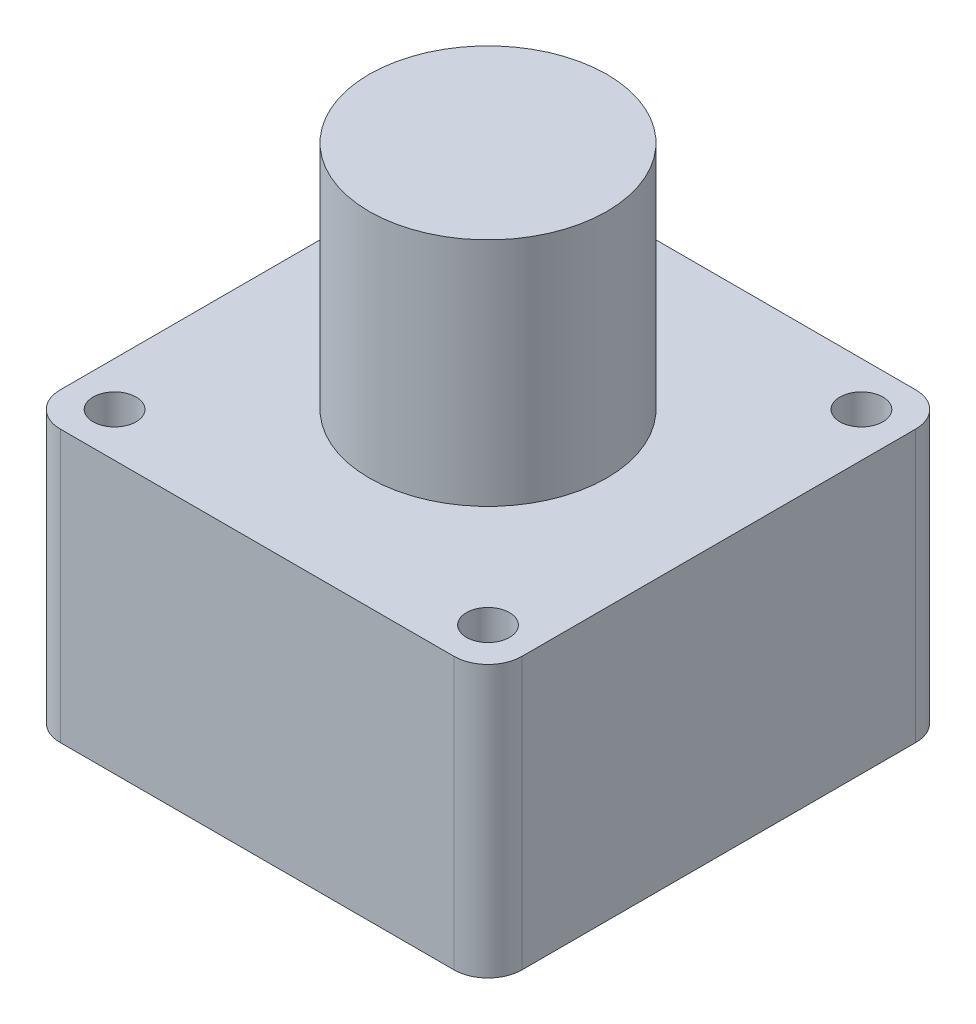
ISO-10303-21;
HEADER;
FILE_DESCRIPTION(('STEP AP214'),'2;1');
FILE_NAME('part.step','',(''),(''),'','','');
FILE_SCHEMA(('AUTOMOTIVE_DESIGN { 1 0 10303 214 1 1 1 1 }'));
ENDSEC;
DATA;
#1=APPLICATION_CONTEXT('core data for automotive mechanical design processes');
#2=APPLICATION_PROTOCOL_DEFINITION('international standard','automotive_design',2000,#1);
#3=PRODUCT_CONTEXT('',#1,'mechanical');
#4=PRODUCT('Part','Part','',(#3));
#5=PRODUCT_RELATED_PRODUCT_CATEGORY('part','',(#4));
#6=PRODUCT_DEFINITION_FORMATION('','',#4);
#7=PRODUCT_DEFINITION_CONTEXT('part definition',#1,'design');
#8=PRODUCT_DEFINITION('design','',#6,#7);
#9=PRODUCT_DEFINITION_SHAPE('','',#8);
#10=(LENGTH_UNIT() NAMED_UNIT(*) SI_UNIT(.MILLI.,.METRE.));
#11=(NAMED_UNIT(*) PLANE_ANGLE_UNIT() SI_UNIT($,.RADIAN.));
#12=(NAMED_UNIT(*) SI_UNIT($,.STERADIAN.) SOLID_ANGLE_UNIT());
#13=UNCERTAINTY_MEASURE_WITH_UNIT(LENGTH_MEASURE(1.E-05),#10,'distance_accuracy_value','');
#14=(GEOMETRIC_REPRESENTATION_CONTEXT(3) GLOBAL_UNCERTAINTY_ASSIGNED_CONTEXT((#13)) GLOBAL_UNIT_ASSIGNED_CONTEXT((#10,
#11,#12)) REPRESENTATION_CONTEXT('',''));
#15=CARTESIAN_POINT('',(0.,0.,0.));
#16=DIRECTION('',(0.,0.,1.));
#17=DIRECTION('',(1.,0.,0.));
#18=AXIS2_PLACEMENT_3D('',#15,#16,#17);
#19=CARTESIAN_POINT('',(-29.,40.,-29.));
#20=DIRECTION('',(0.,-1.,0.));
#21=DIRECTION('',(0.,0.,-1.));
#22=AXIS2_PLACEMENT_3D('',#19,#20,#21);
#23=CYLINDRICAL_SURFACE('',#22,5.);
#24=CARTESIAN_POINT('',(-29.,0.,-29.));
#25=DIRECTION('',(0.,1.,0.));
#26=DIRECTION('',(0.,0.,1.));
#27=AXIS2_PLACEMENT_3D('',#24,#25,#26);
#28=CIRCLE('',#27,5.);
#29=CARTESIAN_POINT('',(-29.,0.,-34.));
#30=VERTEX_POINT('',#29);
#31=CARTESIAN_POINT('',(-34.,0.,-29.));
#32=VERTEX_POINT('',#31);
#33=EDGE_CURVE('E141',#30,#32,#28,.T.);
#34=ORIENTED_EDGE('',*,*,#33,.T.);
#35=DIRECTION('',(0.,-1.,0.));
#36=VECTOR('',#35,1.);
#37=CARTESIAN_POINT('',(-34.,40.,-29.));
#38=LINE('',#37,#36);
#39=CARTESIAN_POINT('',(-34.,40.,-29.));
#40=VERTEX_POINT('',#39);
#41=EDGE_CURVE('E41',#40,#32,#38,.T.);
#42=ORIENTED_EDGE('',*,*,#41,.F.);
#43=CARTESIAN_POINT('',(-29.,40.,-29.));
#44=DIRECTION('',(0.,1.,0.));
#45=DIRECTION('',(0.,0.,1.));
#46=AXIS2_PLACEMENT_3D('',#43,#44,#45);
#47=CIRCLE('',#46,5.);
#48=CARTESIAN_POINT('',(-29.,40.,-34.));
#49=VERTEX_POINT('',#48);
#50=EDGE_CURVE('E167',#49,#40,#47,.T.);
#51=ORIENTED_EDGE('',*,*,#50,.F.);
#52=DIRECTION('',(0.,-1.,0.));
#53=VECTOR('',#52,1.);
#54=CARTESIAN_POINT('',(-29.,40.,-34.));
#55=LINE('',#54,#53);
#56=EDGE_CURVE('E56',#49,#30,#55,.T.);
#57=ORIENTED_EDGE('',*,*,#56,.T.);
#58=EDGE_LOOP('',(#34,#42,#51,#57));
#59=FACE_BOUND('',#58,.T.);
#60=ADVANCED_FACE('F38',(#59),#23,.T.);
#61=CARTESIAN_POINT('',(-34.,40.,-29.));
#62=DIRECTION('',(1.,0.,0.));
#63=DIRECTION('',(0.,0.,-1.));
#64=AXIS2_PLACEMENT_3D('',#61,#62,#63);
#65=PLANE('',#64);
#66=DIRECTION('',(0.,0.,1.));
#67=VECTOR('',#66,1.);
#68=CARTESIAN_POINT('',(-34.,0.,-29.));
#69=LINE('',#68,#67);
#70=CARTESIAN_POINT('',(-34.,0.,29.));
#71=VERTEX_POINT('',#70);
#72=EDGE_CURVE('E144',#32,#71,#69,.T.);
#73=ORIENTED_EDGE('',*,*,#72,.T.);
#74=DIRECTION('',(0.,-1.,0.));
#75=VECTOR('',#74,1.);
#76=CARTESIAN_POINT('',(-34.,40.,29.));
#77=LINE('',#76,#75);
#78=CARTESIAN_POINT('',(-34.,40.,29.));
#79=VERTEX_POINT('',#78);
#80=EDGE_CURVE('E181',#79,#71,#77,.T.);
#81=ORIENTED_EDGE('',*,*,#80,.F.);
#82=DIRECTION('',(0.,0.,1.));
#83=VECTOR('',#82,1.);
#84=CARTESIAN_POINT('',(-34.,40.,-29.));
#85=LINE('',#84,#83);
#86=EDGE_CURVE('E95',#40,#79,#85,.T.);
#87=ORIENTED_EDGE('',*,*,#86,.F.);
#88=ORIENTED_EDGE('',*,*,#41,.T.);
#89=EDGE_LOOP('',(#73,#81,#87,#88));
#90=FACE_BOUND('',#89,.T.);
#91=ADVANCED_FACE('F189',(#90),#65,.F.);
#92=CARTESIAN_POINT('',(-29.,40.,29.));
#93=DIRECTION('',(0.,-1.,0.));
#94=DIRECTION('',(0.,0.,-1.));
#95=AXIS2_PLACEMENT_3D('',#92,#93,#94);
#96=CYLINDRICAL_SURFACE('',#95,5.);
#97=CARTESIAN_POINT('',(-29.,0.,29.));
#98=DIRECTION('',(0.,1.,0.));
#99=DIRECTION('',(0.,0.,1.));
#100=AXIS2_PLACEMENT_3D('',#97,#98,#99);
#101=CIRCLE('',#100,5.);
#102=CARTESIAN_POINT('',(-29.,0.,34.));
#103=VERTEX_POINT('',#102);
#104=EDGE_CURVE('E148',#71,#103,#101,.T.);
#105=ORIENTED_EDGE('',*,*,#104,.T.);
#106=DIRECTION('',(0.,-1.,0.));
#107=VECTOR('',#106,1.);
#108=CARTESIAN_POINT('',(-29.,40.,34.));
#109=LINE('',#108,#107);
#110=CARTESIAN_POINT('',(-29.,40.,34.));
#111=VERTEX_POINT('',#110);
#112=EDGE_CURVE('E178',#111,#103,#109,.T.);
#113=ORIENTED_EDGE('',*,*,#112,.F.);
#114=CARTESIAN_POINT('',(-29.,40.,29.));
#115=DIRECTION('',(0.,1.,0.));
#116=DIRECTION('',(0.,0.,1.));
#117=AXIS2_PLACEMENT_3D('',#114,#115,#116);
#118=CIRCLE('',#117,5.);
#119=EDGE_CURVE('E342',#79,#111,#118,.T.);
#120=ORIENTED_EDGE('',*,*,#119,.F.);
#121=ORIENTED_EDGE('',*,*,#80,.T.);
#122=EDGE_LOOP('',(#105,#113,#120,#121));
#123=FACE_BOUND('',#122,.T.);
#124=ADVANCED_FACE('F208',(#123),#96,.T.);
#125=CARTESIAN_POINT('',(-29.,40.,34.));
#126=DIRECTION('',(0.,0.,-1.));
#127=DIRECTION('',(-1.,0.,0.));
#128=AXIS2_PLACEMENT_3D('',#125,#126,#127);
#129=PLANE('',#128);
#130=DIRECTION('',(1.,0.,0.));
#131=VECTOR('',#130,1.);
#132=CARTESIAN_POINT('',(-29.,0.,34.));
#133=LINE('',#132,#131);
#134=CARTESIAN_POINT('',(29.,0.,34.));
#135=VERTEX_POINT('',#134);
#136=EDGE_CURVE('E151',#103,#135,#133,.T.);
#137=ORIENTED_EDGE('',*,*,#136,.T.);
#138=DIRECTION('',(0.,-1.,0.));
#139=VECTOR('',#138,1.);
#140=CARTESIAN_POINT('',(29.,40.,34.));
#141=LINE('',#140,#139);
#142=CARTESIAN_POINT('',(29.,40.,34.));
#143=VERTEX_POINT('',#142);
#144=EDGE_CURVE('E174',#143,#135,#141,.T.);
#145=ORIENTED_EDGE('',*,*,#144,.F.);
#146=DIRECTION('',(1.,0.,0.));
#147=VECTOR('',#146,1.);
#148=CARTESIAN_POINT('',(-29.,40.,34.));
#149=LINE('',#148,#147);
#150=EDGE_CURVE('E345',#111,#143,#149,.T.);
#151=ORIENTED_EDGE('',*,*,#150,.F.);
#152=ORIENTED_EDGE('',*,*,#112,.T.);
#153=EDGE_LOOP('',(#137,#145,#151,#152));
#154=FACE_BOUND('',#153,.T.);
#155=ADVANCED_FACE('F212',(#154),#129,.F.);
#156=CARTESIAN_POINT('',(29.,40.,29.));
#157=DIRECTION('',(0.,-1.,0.));
#158=DIRECTION('',(0.,0.,-1.));
#159=AXIS2_PLACEMENT_3D('',#156,#157,#158);
#160=CYLINDRICAL_SURFACE('',#159,5.);
#161=CARTESIAN_POINT('',(29.,0.,29.));
#162=DIRECTION('',(0.,1.,0.));
#163=DIRECTION('',(0.,0.,1.));
#164=AXIS2_PLACEMENT_3D('',#161,#162,#163);
#165=CIRCLE('',#164,5.);
#166=CARTESIAN_POINT('',(34.,0.,29.));
#167=VERTEX_POINT('',#166);
#168=EDGE_CURVE('E154',#135,#167,#165,.T.);
#169=ORIENTED_EDGE('',*,*,#168,.T.);
#170=DIRECTION('',(0.,-1.,0.));
#171=VECTOR('',#170,1.);
#172=CARTESIAN_POINT('',(34.,40.,29.));
#173=LINE('',#172,#171);
#174=CARTESIAN_POINT('',(34.,40.,29.));
#175=VERTEX_POINT('',#174);
#176=EDGE_CURVE('E121',#175,#167,#173,.T.);
#177=ORIENTED_EDGE('',*,*,#176,.F.);
#178=CARTESIAN_POINT('',(29.,40.,29.));
#179=DIRECTION('',(0.,1.,0.));
#180=DIRECTION('',(0.,0.,1.));
#181=AXIS2_PLACEMENT_3D('',#178,#179,#180);
#182=CIRCLE('',#181,5.);
#183=EDGE_CURVE('E129',#143,#175,#182,.T.);
#184=ORIENTED_EDGE('',*,*,#183,.F.);
#185=ORIENTED_EDGE('',*,*,#144,.T.);
#186=EDGE_LOOP('',(#169,#177,#184,#185));
#187=FACE_BOUND('',#186,.T.);
#188=ADVANCED_FACE('F217',(#187),#160,.T.);
#189=CARTESIAN_POINT('',(34.,40.,-29.));
#190=DIRECTION('',(1.,0.,0.));
#191=DIRECTION('',(0.,0.,-1.));
#192=AXIS2_PLACEMENT_3D('',#189,#190,#191);
#193=PLANE('',#192);
#194=DIRECTION('',(0.,0.,1.));
#195=VECTOR('',#194,1.);
#196=CARTESIAN_POINT('',(34.,0.,-29.));
#197=LINE('',#196,#195);
#198=CARTESIAN_POINT('',(34.,0.,-29.));
#199=VERTEX_POINT('',#198);
#200=EDGE_CURVE('E116',#199,#167,#197,.T.);
#201=ORIENTED_EDGE('',*,*,#200,.F.);
#202=DIRECTION('',(0.,-1.,0.));
#203=VECTOR('',#202,1.);
#204=CARTESIAN_POINT('',(34.,40.,-29.));
#205=LINE('',#204,#203);
#206=CARTESIAN_POINT('',(34.,40.,-29.));
#207=VERTEX_POINT('',#206);
#208=EDGE_CURVE('E111',#207,#199,#205,.T.);
#209=ORIENTED_EDGE('',*,*,#208,.F.);
#210=DIRECTION('',(0.,0.,1.));
#211=VECTOR('',#210,1.);
#212=CARTESIAN_POINT('',(34.,40.,-29.));
#213=LINE('',#212,#211);
#214=EDGE_CURVE('E114',#207,#175,#213,.T.);
#215=ORIENTED_EDGE('',*,*,#214,.T.);
#216=ORIENTED_EDGE('',*,*,#176,.T.);
#217=EDGE_LOOP('',(#201,#209,#215,#216));
#218=FACE_BOUND('',#217,.T.);
#219=ADVANCED_FACE('F113',(#218),#193,.T.);
#220=CARTESIAN_POINT('',(29.,40.,-29.));
#221=DIRECTION('',(0.,-1.,0.));
#222=DIRECTION('',(0.,0.,-1.));
#223=AXIS2_PLACEMENT_3D('',#220,#221,#222);
#224=CYLINDRICAL_SURFACE('',#223,5.);
#225=CARTESIAN_POINT('',(29.,0.,-29.));
#226=DIRECTION('',(0.,-1.,0.));
#227=DIRECTION('',(0.,0.,-1.));
#228=AXIS2_PLACEMENT_3D('',#225,#226,#227);
#229=CIRCLE('',#228,5.);
#230=CARTESIAN_POINT('',(29.,0.,-34.));
#231=VERTEX_POINT('',#230);
#232=EDGE_CURVE('E160',#231,#199,#229,.T.);
#233=ORIENTED_EDGE('',*,*,#232,.F.);
#234=DIRECTION('',(0.,-1.,0.));
#235=VECTOR('',#234,1.);
#236=CARTESIAN_POINT('',(29.,40.,-34.));
#237=LINE('',#236,#235);
#238=CARTESIAN_POINT('',(29.,40.,-34.));
#239=VERTEX_POINT('',#238);
#240=EDGE_CURVE('E82',#239,#231,#237,.T.);
#241=ORIENTED_EDGE('',*,*,#240,.F.);
#242=CARTESIAN_POINT('',(29.,40.,-29.));
#243=DIRECTION('',(0.,-1.,0.));
#244=DIRECTION('',(0.,0.,-1.));
#245=AXIS2_PLACEMENT_3D('',#242,#243,#244);
#246=CIRCLE('',#245,5.);
#247=EDGE_CURVE('E127',#239,#207,#246,.T.);
#248=ORIENTED_EDGE('',*,*,#247,.T.);
#249=ORIENTED_EDGE('',*,*,#208,.T.);
#250=EDGE_LOOP('',(#233,#241,#248,#249));
#251=FACE_BOUND('',#250,.T.);
#252=ADVANCED_FACE('F133',(#251),#224,.T.);
#253=CARTESIAN_POINT('',(-29.,40.,-34.));
#254=DIRECTION('',(0.,0.,-1.));
#255=DIRECTION('',(-1.,0.,0.));
#256=AXIS2_PLACEMENT_3D('',#253,#254,#255);
#257=PLANE('',#256);
#258=DIRECTION('',(1.,0.,0.));
#259=VECTOR('',#258,1.);
#260=CARTESIAN_POINT('',(-29.,0.,-34.));
#261=LINE('',#260,#259);
#262=EDGE_CURVE('E163',#30,#231,#261,.T.);
#263=ORIENTED_EDGE('',*,*,#262,.F.);
#264=ORIENTED_EDGE('',*,*,#56,.F.);
#265=DIRECTION('',(1.,0.,0.));
#266=VECTOR('',#265,1.);
#267=CARTESIAN_POINT('',(-29.,40.,-34.));
#268=LINE('',#267,#266);
#269=EDGE_CURVE('E135',#49,#239,#268,.T.);
#270=ORIENTED_EDGE('',*,*,#269,.T.);
#271=ORIENTED_EDGE('',*,*,#240,.T.);
#272=EDGE_LOOP('',(#263,#264,#270,#271));
#273=FACE_BOUND('',#272,.T.);
#274=ADVANCED_FACE('F192',(#273),#257,.T.);
#275=CARTESIAN_POINT('',(-29.,40.,-29.));
#276=DIRECTION('',(0.,1.,0.));
#277=DIRECTION('',(0.,0.,1.));
#278=AXIS2_PLACEMENT_3D('',#275,#276,#277);
#279=PLANE('',#278);
#280=CARTESIAN_POINT('',(27.5,40.,-27.5));
#281=DIRECTION('',(0.,1.,0.));
#282=DIRECTION('',(0.,0.,-1.));
#283=AXIS2_PLACEMENT_3D('',#280,#281,#282);
#284=CIRCLE('',#283,3.16747945535428);
#285=CARTESIAN_POINT('',(27.5,40.,-30.6674794553543));
#286=VERTEX_POINT('',#285);
#287=EDGE_CURVE('E311',#286,#286,#284,.T.);
#288=ORIENTED_EDGE('',*,*,#287,.F.);
#289=EDGE_LOOP('',(#288));
#290=FACE_BOUND('',#289,.T.);
#291=CARTESIAN_POINT('',(-27.5,40.,27.5));
#292=DIRECTION('',(0.,1.,0.));
#293=DIRECTION('',(0.,0.,-1.));
#294=AXIS2_PLACEMENT_3D('',#291,#292,#293);
#295=CIRCLE('',#294,3.16747945535428);
#296=CARTESIAN_POINT('',(-27.5,40.,24.3325205446457));
#297=VERTEX_POINT('',#296);
#298=EDGE_CURVE('E316',#297,#297,#295,.T.);
#299=ORIENTED_EDGE('',*,*,#298,.F.);
#300=EDGE_LOOP('',(#299));
#301=FACE_BOUND('',#300,.T.);
#302=CARTESIAN_POINT('',(27.5,40.,27.5));
#303=DIRECTION('',(0.,1.,0.));
#304=DIRECTION('',(0.,0.,1.));
#305=AXIS2_PLACEMENT_3D('',#302,#303,#304);
#306=CIRCLE('',#305,3.16747945535428);
#307=CARTESIAN_POINT('',(27.5,40.,30.6674794553543));
#308=VERTEX_POINT('',#307);
#309=EDGE_CURVE('E351',#308,#308,#306,.T.);
#310=ORIENTED_EDGE('',*,*,#309,.F.);
#311=EDGE_LOOP('',(#310));
#312=FACE_BOUND('',#311,.T.);
#313=CARTESIAN_POINT('',(-27.5,40.,-27.5));
#314=DIRECTION('',(0.,1.,0.));
#315=DIRECTION('',(0.,0.,1.));
#316=AXIS2_PLACEMENT_3D('',#313,#314,#315);
#317=CIRCLE('',#316,3.16747945535428);
#318=CARTESIAN_POINT('',(-27.5,40.,-24.3325205446457));
#319=VERTEX_POINT('',#318);
#320=EDGE_CURVE('E326',#319,#319,#317,.T.);
#321=ORIENTED_EDGE('',*,*,#320,.F.);
#322=EDGE_LOOP('',(#321));
#323=FACE_BOUND('',#322,.T.);
#324=CARTESIAN_POINT('',(0.,40.,0.));
#325=DIRECTION('',(0.,1.,0.));
#326=DIRECTION('',(0.,0.,1.));
#327=AXIS2_PLACEMENT_3D('',#324,#325,#326);
#328=CIRCLE('',#327,17.5);
#329=CARTESIAN_POINT('',(0.,40.,17.5));
#330=VERTEX_POINT('',#329);
#331=EDGE_CURVE('E11',#330,#330,#328,.T.);
#332=ORIENTED_EDGE('',*,*,#331,.F.);
#333=EDGE_LOOP('',(#332));
#334=FACE_BOUND('',#333,.T.);
#335=ORIENTED_EDGE('',*,*,#50,.T.);
#336=ORIENTED_EDGE('',*,*,#86,.T.);
#337=ORIENTED_EDGE('',*,*,#119,.T.);
#338=ORIENTED_EDGE('',*,*,#150,.T.);
#339=ORIENTED_EDGE('',*,*,#183,.T.);
#340=ORIENTED_EDGE('',*,*,#214,.F.);
#341=ORIENTED_EDGE('',*,*,#247,.F.);
#342=ORIENTED_EDGE('',*,*,#269,.F.);
#343=EDGE_LOOP('',(#335,#336,#337,#338,#339,#340,#341,#342));
#344=FACE_BOUND('',#343,.T.);
#345=ADVANCED_FACE('F125',(#290,#301,#312,#323,#334,#344),#279,.T.);
#346=CARTESIAN_POINT('',(-29.,0.,-29.));
#347=DIRECTION('',(0.,1.,0.));
#348=DIRECTION('',(0.,0.,1.));
#349=AXIS2_PLACEMENT_3D('',#346,#347,#348);
#350=PLANE('',#349);
#351=CARTESIAN_POINT('',(27.5,0.,-27.5));
#352=DIRECTION('',(0.,1.,0.));
#353=DIRECTION('',(0.,0.,1.));
#354=AXIS2_PLACEMENT_3D('',#351,#352,#353);
#355=CIRCLE('',#354,3.16747945535428);
#356=CARTESIAN_POINT('',(27.5,0.,-24.3325205446457));
#357=VERTEX_POINT('',#356);
#358=EDGE_CURVE('E314',#357,#357,#355,.F.);
#359=ORIENTED_EDGE('',*,*,#358,.F.);
#360=EDGE_LOOP('',(#359));
#361=FACE_BOUND('',#360,.T.);
#362=CARTESIAN_POINT('',(-27.5,0.,27.5));
#363=DIRECTION('',(0.,1.,0.));
#364=DIRECTION('',(0.,0.,1.));
#365=AXIS2_PLACEMENT_3D('',#362,#363,#364);
#366=CIRCLE('',#365,3.16747945535428);
#367=CARTESIAN_POINT('',(-27.5,0.,30.6674794553543));
#368=VERTEX_POINT('',#367);
#369=EDGE_CURVE('E321',#368,#368,#366,.F.);
#370=ORIENTED_EDGE('',*,*,#369,.F.);
#371=EDGE_LOOP('',(#370));
#372=FACE_BOUND('',#371,.T.);
#373=CARTESIAN_POINT('',(27.5,0.,27.5));
#374=DIRECTION('',(0.,1.,0.));
#375=DIRECTION('',(0.,0.,1.));
#376=AXIS2_PLACEMENT_3D('',#373,#374,#375);
#377=CIRCLE('',#376,3.16747945535428);
#378=CARTESIAN_POINT('',(27.5,0.,30.6674794553543));
#379=VERTEX_POINT('',#378);
#380=EDGE_CURVE('E331',#379,#379,#377,.F.);
#381=ORIENTED_EDGE('',*,*,#380,.F.);
#382=EDGE_LOOP('',(#381));
#383=FACE_BOUND('',#382,.T.);
#384=CARTESIAN_POINT('',(-27.5,0.,-27.5));
#385=DIRECTION('',(0.,1.,0.));
#386=DIRECTION('',(0.,0.,1.));
#387=AXIS2_PLACEMENT_3D('',#384,#385,#386);
#388=CIRCLE('',#387,3.16747945535428);
#389=CARTESIAN_POINT('',(-27.5,0.,-24.3325205446457));
#390=VERTEX_POINT('',#389);
#391=EDGE_CURVE('E330',#390,#390,#388,.F.);
#392=ORIENTED_EDGE('',*,*,#391,.F.);
#393=EDGE_LOOP('',(#392));
#394=FACE_BOUND('',#393,.T.);
#395=ORIENTED_EDGE('',*,*,#33,.F.);
#396=ORIENTED_EDGE('',*,*,#262,.T.);
#397=ORIENTED_EDGE('',*,*,#232,.T.);
#398=ORIENTED_EDGE('',*,*,#200,.T.);
#399=ORIENTED_EDGE('',*,*,#168,.F.);
#400=ORIENTED_EDGE('',*,*,#136,.F.);
#401=ORIENTED_EDGE('',*,*,#104,.F.);
#402=ORIENTED_EDGE('',*,*,#72,.F.);
#403=EDGE_LOOP('',(#395,#396,#397,#398,#399,#400,#401,#402));
#404=FACE_BOUND('',#403,.T.);
#405=ADVANCED_FACE('F191',(#361,#372,#383,#394,#404),#350,.F.);
#406=CARTESIAN_POINT('',(0.,74.,0.));
#407=DIRECTION('',(0.,-1.,0.));
#408=DIRECTION('',(0.,0.,-1.));
#409=AXIS2_PLACEMENT_3D('',#406,#407,#408);
#410=CYLINDRICAL_SURFACE('',#409,17.5);
#411=CARTESIAN_POINT('',(0.,74.,0.));
#412=DIRECTION('',(0.,1.,0.));
#413=DIRECTION('',(0.,0.,1.));
#414=AXIS2_PLACEMENT_3D('',#411,#412,#413);
#415=CIRCLE('',#414,17.5);
#416=CARTESIAN_POINT('',(0.,74.,17.5));
#417=VERTEX_POINT('',#416);
#418=EDGE_CURVE('E145',#417,#417,#415,.T.);
#419=ORIENTED_EDGE('',*,*,#418,.F.);
#420=EDGE_LOOP('',(#419));
#421=FACE_BOUND('',#420,.T.);
#422=ORIENTED_EDGE('',*,*,#331,.T.);
#423=EDGE_LOOP('',(#422));
#424=FACE_BOUND('',#423,.T.);
#425=ADVANCED_FACE('F241',(#421,#424),#410,.T.);
#426=CARTESIAN_POINT('',(0.,74.,0.));
#427=DIRECTION('',(0.,1.,0.));
#428=DIRECTION('',(0.,0.,1.));
#429=AXIS2_PLACEMENT_3D('',#426,#427,#428);
#430=PLANE('',#429);
#431=ORIENTED_EDGE('',*,*,#418,.T.);
#432=EDGE_LOOP('',(#431));
#433=FACE_BOUND('',#432,.T.);
#434=ADVANCED_FACE('F246',(#433),#430,.T.);
#435=CARTESIAN_POINT('',(-27.5,-0.001000000000001,-27.5));
#436=DIRECTION('',(0.,1.,0.));
#437=DIRECTION('',(0.,0.,1.));
#438=AXIS2_PLACEMENT_3D('',#435,#436,#437);
#439=CYLINDRICAL_SURFACE('',#438,3.16747945535428);
#440=ORIENTED_EDGE('',*,*,#320,.T.);
#441=EDGE_LOOP('',(#440));
#442=FACE_BOUND('',#441,.T.);
#443=ORIENTED_EDGE('',*,*,#391,.T.);
#444=EDGE_LOOP('',(#443));
#445=FACE_BOUND('',#444,.T.);
#446=ADVANCED_FACE('F257',(#442,#445),#439,.F.);
#447=CARTESIAN_POINT('',(27.5,-0.001000000000001,27.5));
#448=DIRECTION('',(0.,1.,0.));
#449=DIRECTION('',(0.,0.,1.));
#450=AXIS2_PLACEMENT_3D('',#447,#448,#449);
#451=CYLINDRICAL_SURFACE('',#450,3.16747945535428);
#452=ORIENTED_EDGE('',*,*,#309,.T.);
#453=EDGE_LOOP('',(#452));
#454=FACE_BOUND('',#453,.T.);
#455=ORIENTED_EDGE('',*,*,#380,.T.);
#456=EDGE_LOOP('',(#455));
#457=FACE_BOUND('',#456,.T.);
#458=ADVANCED_FACE('F274',(#454,#457),#451,.F.);
#459=CARTESIAN_POINT('',(-27.5,-0.001000000000001,27.5));
#460=DIRECTION('',(0.,1.,0.));
#461=DIRECTION('',(0.,0.,1.));
#462=AXIS2_PLACEMENT_3D('',#459,#460,#461);
#463=CYLINDRICAL_SURFACE('',#462,3.16747945535428);
#464=ORIENTED_EDGE('',*,*,#298,.T.);
#465=EDGE_LOOP('',(#464));
#466=FACE_BOUND('',#465,.T.);
#467=ORIENTED_EDGE('',*,*,#369,.T.);
#468=EDGE_LOOP('',(#467));
#469=FACE_BOUND('',#468,.T.);
#470=ADVANCED_FACE('F284',(#466,#469),#463,.F.);
#471=CARTESIAN_POINT('',(27.5,-0.001000000000001,-27.5));
#472=DIRECTION('',(0.,1.,0.));
#473=DIRECTION('',(0.,0.,1.));
#474=AXIS2_PLACEMENT_3D('',#471,#472,#473);
#475=CYLINDRICAL_SURFACE('',#474,3.16747945535428);
#476=ORIENTED_EDGE('',*,*,#287,.T.);
#477=EDGE_LOOP('',(#476));
#478=FACE_BOUND('',#477,.T.);
#479=ORIENTED_EDGE('',*,*,#358,.T.);
#480=EDGE_LOOP('',(#479));
#481=FACE_BOUND('',#480,.T.);
#482=ADVANCED_FACE('F294',(#478,#481),#475,.F.);
#483=CLOSED_SHELL('',(#60,#91,#124,#155,#188,#219,#252,#274,#345,#405,#425,#434,#446,#458,#470,#482));
#484=MANIFOLD_SOLID_BREP('B2',#483);
#485=ADVANCED_BREP_SHAPE_REPRESENTATION('',(#18,#484),#14);
#486=SHAPE_DEFINITION_REPRESENTATION(#9,#485);
ENDSEC;
END-ISO-10303-21;
